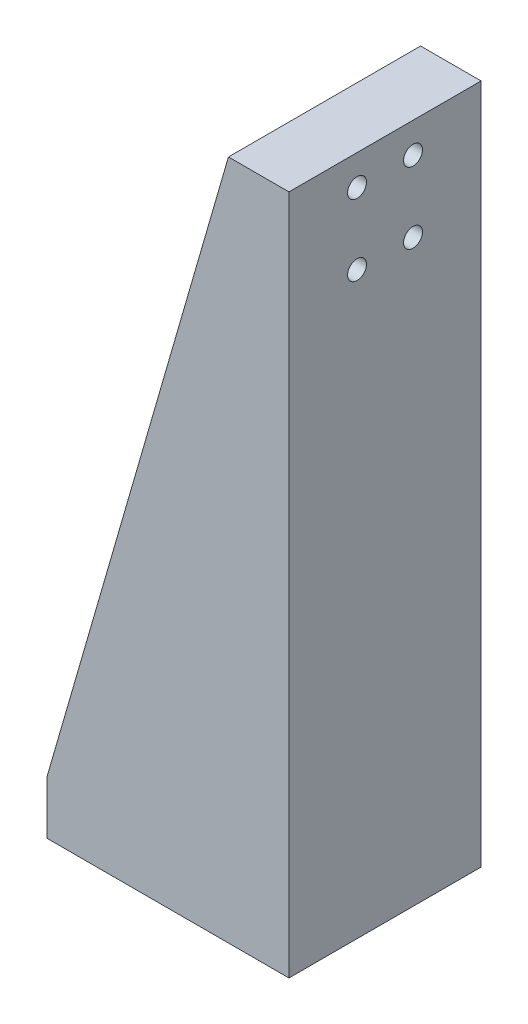
ISO-10303-21;
HEADER;
FILE_DESCRIPTION(('STEP AP214'),'2;1');
FILE_NAME('part.step','',(''),(''),'','','');
FILE_SCHEMA(('AUTOMOTIVE_DESIGN { 1 0 10303 214 1 1 1 1 }'));
ENDSEC;
DATA;
#1=APPLICATION_CONTEXT('core data for automotive mechanical design processes');
#2=APPLICATION_PROTOCOL_DEFINITION('international standard','automotive_design',2000,#1);
#3=PRODUCT_CONTEXT('',#1,'mechanical');
#4=PRODUCT('Part','Part','',(#3));
#5=PRODUCT_RELATED_PRODUCT_CATEGORY('part','',(#4));
#6=PRODUCT_DEFINITION_FORMATION('','',#4);
#7=PRODUCT_DEFINITION_CONTEXT('part definition',#1,'design');
#8=PRODUCT_DEFINITION('design','',#6,#7);
#9=PRODUCT_DEFINITION_SHAPE('','',#8);
#10=(LENGTH_UNIT() NAMED_UNIT(*) SI_UNIT(.MILLI.,.METRE.));
#11=(NAMED_UNIT(*) PLANE_ANGLE_UNIT() SI_UNIT($,.RADIAN.));
#12=(NAMED_UNIT(*) SI_UNIT($,.STERADIAN.) SOLID_ANGLE_UNIT());
#13=UNCERTAINTY_MEASURE_WITH_UNIT(LENGTH_MEASURE(1.E-05),#10,'distance_accuracy_value','');
#14=(GEOMETRIC_REPRESENTATION_CONTEXT(3) GLOBAL_UNCERTAINTY_ASSIGNED_CONTEXT((#13)) GLOBAL_UNIT_ASSIGNED_CONTEXT((#10,
#11,#12)) REPRESENTATION_CONTEXT('',''));
#15=CARTESIAN_POINT('',(0.,0.,0.));
#16=DIRECTION('',(0.,0.,1.));
#17=DIRECTION('',(1.,0.,0.));
#18=AXIS2_PLACEMENT_3D('',#15,#16,#17);
#19=CARTESIAN_POINT('',(32.,90.,25.4));
#20=DIRECTION('',(-1.,0.,0.));
#21=DIRECTION('',(0.,-1.,0.));
#22=AXIS2_PLACEMENT_3D('',#19,#20,#21);
#23=PLANE('',#22);
#24=DIRECTION('',(0.,1.,0.));
#25=VECTOR('',#24,1.);
#26=CARTESIAN_POINT('',(32.,90.,0.));
#27=LINE('',#26,#25);
#28=CARTESIAN_POINT('',(32.,0.,0.));
#29=VERTEX_POINT('',#28);
#30=CARTESIAN_POINT('',(32.,90.,0.));
#31=VERTEX_POINT('',#30);
#32=EDGE_CURVE('E138',#29,#31,#27,.T.);
#33=ORIENTED_EDGE('',*,*,#32,.T.);
#34=DIRECTION('',(0.,0.,-1.));
#35=VECTOR('',#34,1.);
#36=CARTESIAN_POINT('',(32.,90.,25.4));
#37=LINE('',#36,#35);
#38=CARTESIAN_POINT('',(32.,90.,25.4));
#39=VERTEX_POINT('',#38);
#40=EDGE_CURVE('E43',#39,#31,#37,.T.);
#41=ORIENTED_EDGE('',*,*,#40,.F.);
#42=DIRECTION('',(0.,1.,0.));
#43=VECTOR('',#42,1.);
#44=CARTESIAN_POINT('',(32.,90.,25.4));
#45=LINE('',#44,#43);
#46=CARTESIAN_POINT('',(32.,0.,25.4));
#47=VERTEX_POINT('',#46);
#48=EDGE_CURVE('E118',#47,#39,#45,.T.);
#49=ORIENTED_EDGE('',*,*,#48,.F.);
#50=DIRECTION('',(0.,0.,-1.));
#51=VECTOR('',#50,1.);
#52=CARTESIAN_POINT('',(32.,0.,25.4));
#53=LINE('',#52,#51);
#54=EDGE_CURVE('E11',#47,#29,#53,.T.);
#55=ORIENTED_EDGE('',*,*,#54,.T.);
#56=EDGE_LOOP('',(#33,#41,#49,#55));
#57=FACE_BOUND('',#56,.T.);
#58=CARTESIAN_POINT('',(32.,76.6,9.));
#59=DIRECTION('',(1.,0.,0.));
#60=DIRECTION('',(0.,0.,-1.));
#61=AXIS2_PLACEMENT_3D('',#58,#59,#60);
#62=CIRCLE('',#61,1.25);
#63=CARTESIAN_POINT('',(32.,76.6,7.75));
#64=VERTEX_POINT('',#63);
#65=EDGE_CURVE('E192',#64,#64,#62,.T.);
#66=ORIENTED_EDGE('',*,*,#65,.F.);
#67=EDGE_LOOP('',(#66));
#68=FACE_BOUND('',#67,.T.);
#69=CARTESIAN_POINT('',(32.,86.,16.4));
#70=DIRECTION('',(1.,0.,0.));
#71=DIRECTION('',(0.,0.,-1.));
#72=AXIS2_PLACEMENT_3D('',#69,#70,#71);
#73=CIRCLE('',#72,1.25);
#74=CARTESIAN_POINT('',(32.,86.,15.15));
#75=VERTEX_POINT('',#74);
#76=EDGE_CURVE('E198',#75,#75,#73,.T.);
#77=ORIENTED_EDGE('',*,*,#76,.F.);
#78=EDGE_LOOP('',(#77));
#79=FACE_BOUND('',#78,.T.);
#80=CARTESIAN_POINT('',(32.,76.6,16.4));
#81=DIRECTION('',(1.,0.,0.));
#82=DIRECTION('',(0.,0.,-1.));
#83=AXIS2_PLACEMENT_3D('',#80,#81,#82);
#84=CIRCLE('',#83,1.25);
#85=CARTESIAN_POINT('',(32.,76.6,15.15));
#86=VERTEX_POINT('',#85);
#87=EDGE_CURVE('E204',#86,#86,#84,.T.);
#88=ORIENTED_EDGE('',*,*,#87,.F.);
#89=EDGE_LOOP('',(#88));
#90=FACE_BOUND('',#89,.T.);
#91=CARTESIAN_POINT('',(32.,86.,9.));
#92=DIRECTION('',(1.,0.,0.));
#93=DIRECTION('',(0.,0.,-1.));
#94=AXIS2_PLACEMENT_3D('',#91,#92,#93);
#95=CIRCLE('',#94,1.25);
#96=CARTESIAN_POINT('',(32.,86.,7.75));
#97=VERTEX_POINT('',#96);
#98=EDGE_CURVE('E210',#97,#97,#95,.T.);
#99=ORIENTED_EDGE('',*,*,#98,.F.);
#100=EDGE_LOOP('',(#99));
#101=FACE_BOUND('',#100,.T.);
#102=ADVANCED_FACE('F35',(#57,#68,#79,#90,#101),#23,.F.);
#103=CARTESIAN_POINT('',(24.,7.,25.4));
#104=DIRECTION('',(1.,0.,0.));
#105=DIRECTION('',(0.,0.,-1.));
#106=AXIS2_PLACEMENT_3D('',#103,#104,#105);
#107=PLANE('',#106);
#108=CARTESIAN_POINT('',(24.,86.,9.));
#109=DIRECTION('',(1.,0.,0.));
#110=DIRECTION('',(0.,0.,-1.));
#111=AXIS2_PLACEMENT_3D('',#108,#109,#110);
#112=CIRCLE('',#111,1.25);
#113=CARTESIAN_POINT('',(24.,86.,7.75));
#114=VERTEX_POINT('',#113);
#115=EDGE_CURVE('E207',#114,#114,#112,.T.);
#116=ORIENTED_EDGE('',*,*,#115,.T.);
#117=EDGE_LOOP('',(#116));
#118=FACE_BOUND('',#117,.T.);
#119=CARTESIAN_POINT('',(24.,76.6,16.4));
#120=DIRECTION('',(1.,0.,0.));
#121=DIRECTION('',(0.,0.,-1.));
#122=AXIS2_PLACEMENT_3D('',#119,#120,#121);
#123=CIRCLE('',#122,1.25);
#124=CARTESIAN_POINT('',(24.,76.6,15.15));
#125=VERTEX_POINT('',#124);
#126=EDGE_CURVE('E201',#125,#125,#123,.T.);
#127=ORIENTED_EDGE('',*,*,#126,.T.);
#128=EDGE_LOOP('',(#127));
#129=FACE_BOUND('',#128,.T.);
#130=CARTESIAN_POINT('',(24.,86.,16.4));
#131=DIRECTION('',(1.,0.,0.));
#132=DIRECTION('',(0.,0.,-1.));
#133=AXIS2_PLACEMENT_3D('',#130,#131,#132);
#134=CIRCLE('',#133,1.25);
#135=CARTESIAN_POINT('',(24.,86.,15.15));
#136=VERTEX_POINT('',#135);
#137=EDGE_CURVE('E195',#136,#136,#134,.T.);
#138=ORIENTED_EDGE('',*,*,#137,.T.);
#139=EDGE_LOOP('',(#138));
#140=FACE_BOUND('',#139,.T.);
#141=CARTESIAN_POINT('',(24.,76.6,9.));
#142=DIRECTION('',(1.,0.,0.));
#143=DIRECTION('',(0.,0.,-1.));
#144=AXIS2_PLACEMENT_3D('',#141,#142,#143);
#145=CIRCLE('',#144,1.25);
#146=CARTESIAN_POINT('',(24.,76.6,7.75));
#147=VERTEX_POINT('',#146);
#148=EDGE_CURVE('E179',#147,#147,#145,.T.);
#149=ORIENTED_EDGE('',*,*,#148,.T.);
#150=EDGE_LOOP('',(#149));
#151=FACE_BOUND('',#150,.T.);
#152=DIRECTION('',(0.,1.,0.));
#153=VECTOR('',#152,1.);
#154=CARTESIAN_POINT('',(24.,7.,5.));
#155=LINE('',#154,#153);
#156=CARTESIAN_POINT('',(24.,7.,5.));
#157=VERTEX_POINT('',#156);
#158=CARTESIAN_POINT('',(24.,90.,5.));
#159=VERTEX_POINT('',#158);
#160=EDGE_CURVE('E50',#157,#159,#155,.T.);
#161=ORIENTED_EDGE('',*,*,#160,.F.);
#162=DIRECTION('',(0.,0.,-1.));
#163=VECTOR('',#162,1.);
#164=CARTESIAN_POINT('',(24.,7.,25.4));
#165=LINE('',#164,#163);
#166=CARTESIAN_POINT('',(24.,7.,20.4));
#167=VERTEX_POINT('',#166);
#168=EDGE_CURVE('E125',#167,#157,#165,.T.);
#169=ORIENTED_EDGE('',*,*,#168,.F.);
#170=DIRECTION('',(0.,-1.,0.));
#171=VECTOR('',#170,1.);
#172=CARTESIAN_POINT('',(24.,7.,20.4));
#173=LINE('',#172,#171);
#174=CARTESIAN_POINT('',(24.,90.,20.4));
#175=VERTEX_POINT('',#174);
#176=EDGE_CURVE('E144',#175,#167,#173,.T.);
#177=ORIENTED_EDGE('',*,*,#176,.F.);
#178=DIRECTION('',(0.,0.,-1.));
#179=VECTOR('',#178,1.);
#180=CARTESIAN_POINT('',(24.,90.,25.4));
#181=LINE('',#180,#179);
#182=EDGE_CURVE('E123',#175,#159,#181,.T.);
#183=ORIENTED_EDGE('',*,*,#182,.T.);
#184=EDGE_LOOP('',(#161,#169,#177,#183));
#185=FACE_BOUND('',#184,.T.);
#186=ADVANCED_FACE('F217',(#118,#129,#140,#151,#185),#107,.F.);
#187=CARTESIAN_POINT('',(0.,7.,25.4));
#188=DIRECTION('',(0.,-1.,0.));
#189=DIRECTION('',(0.,0.,-1.));
#190=AXIS2_PLACEMENT_3D('',#187,#188,#189);
#191=PLANE('',#190);
#192=CARTESIAN_POINT('',(4.,7.,16.4));
#193=DIRECTION('',(0.,1.,0.));
#194=DIRECTION('',(0.,0.,1.));
#195=AXIS2_PLACEMENT_3D('',#192,#193,#194);
#196=CIRCLE('',#195,1.55);
#197=CARTESIAN_POINT('',(4.,7.,17.95));
#198=VERTEX_POINT('',#197);
#199=EDGE_CURVE('E176',#198,#198,#196,.T.);
#200=ORIENTED_EDGE('',*,*,#199,.F.);
#201=EDGE_LOOP('',(#200));
#202=FACE_BOUND('',#201,.T.);
#203=CARTESIAN_POINT('',(20.,7.,16.4));
#204=DIRECTION('',(0.,1.,0.));
#205=DIRECTION('',(0.,0.,1.));
#206=AXIS2_PLACEMENT_3D('',#203,#204,#205);
#207=CIRCLE('',#206,1.55);
#208=CARTESIAN_POINT('',(20.,7.,17.95));
#209=VERTEX_POINT('',#208);
#210=EDGE_CURVE('E175',#209,#209,#207,.T.);
#211=ORIENTED_EDGE('',*,*,#210,.F.);
#212=EDGE_LOOP('',(#211));
#213=FACE_BOUND('',#212,.T.);
#214=CARTESIAN_POINT('',(20.,7.,9.));
#215=DIRECTION('',(0.,1.,0.));
#216=DIRECTION('',(0.,0.,1.));
#217=AXIS2_PLACEMENT_3D('',#214,#215,#216);
#218=CIRCLE('',#217,1.55);
#219=CARTESIAN_POINT('',(20.,7.,10.55));
#220=VERTEX_POINT('',#219);
#221=EDGE_CURVE('E183',#220,#220,#218,.T.);
#222=ORIENTED_EDGE('',*,*,#221,.F.);
#223=EDGE_LOOP('',(#222));
#224=FACE_BOUND('',#223,.T.);
#225=CARTESIAN_POINT('',(4.,7.,9.));
#226=DIRECTION('',(0.,1.,0.));
#227=DIRECTION('',(0.,0.,1.));
#228=AXIS2_PLACEMENT_3D('',#225,#226,#227);
#229=CIRCLE('',#228,1.55);
#230=CARTESIAN_POINT('',(4.,7.,10.55));
#231=VERTEX_POINT('',#230);
#232=EDGE_CURVE('E168',#231,#231,#229,.T.);
#233=ORIENTED_EDGE('',*,*,#232,.F.);
#234=EDGE_LOOP('',(#233));
#235=FACE_BOUND('',#234,.T.);
#236=DIRECTION('',(1.,0.,0.));
#237=VECTOR('',#236,1.);
#238=CARTESIAN_POINT('',(0.,7.,5.));
#239=LINE('',#238,#237);
#240=CARTESIAN_POINT('',(0.,7.,5.));
#241=VERTEX_POINT('',#240);
#242=EDGE_CURVE('E152',#241,#157,#239,.T.);
#243=ORIENTED_EDGE('',*,*,#242,.F.);
#244=DIRECTION('',(0.,0.,-1.));
#245=VECTOR('',#244,1.);
#246=CARTESIAN_POINT('',(0.,7.,25.4));
#247=LINE('',#246,#245);
#248=CARTESIAN_POINT('',(0.,7.00000000000003,20.4));
#249=VERTEX_POINT('',#248);
#250=EDGE_CURVE('E129',#249,#241,#247,.T.);
#251=ORIENTED_EDGE('',*,*,#250,.F.);
#252=DIRECTION('',(-1.,0.,0.));
#253=VECTOR('',#252,1.);
#254=CARTESIAN_POINT('',(0.,7.,20.4));
#255=LINE('',#254,#253);
#256=EDGE_CURVE('E111',#167,#249,#255,.T.);
#257=ORIENTED_EDGE('',*,*,#256,.F.);
#258=ORIENTED_EDGE('',*,*,#168,.T.);
#259=EDGE_LOOP('',(#243,#251,#257,#258));
#260=FACE_BOUND('',#259,.T.);
#261=ADVANCED_FACE('F222',(#202,#213,#224,#235,#260),#191,.F.);
#262=CARTESIAN_POINT('',(32.,0.,25.4));
#263=DIRECTION('',(0.,1.,0.));
#264=DIRECTION('',(-1.,0.,0.));
#265=AXIS2_PLACEMENT_3D('',#262,#263,#264);
#266=PLANE('',#265);
#267=CARTESIAN_POINT('',(4.,0.,16.4));
#268=DIRECTION('',(0.,1.,0.));
#269=DIRECTION('',(-1.,0.,0.));
#270=AXIS2_PLACEMENT_3D('',#267,#268,#269);
#271=CIRCLE('',#270,1.55);
#272=CARTESIAN_POINT('',(2.45,0.,16.4));
#273=VERTEX_POINT('',#272);
#274=EDGE_CURVE('E172',#273,#273,#271,.F.);
#275=ORIENTED_EDGE('',*,*,#274,.F.);
#276=EDGE_LOOP('',(#275));
#277=FACE_BOUND('',#276,.T.);
#278=CARTESIAN_POINT('',(20.,0.,16.4));
#279=DIRECTION('',(0.,1.,0.));
#280=DIRECTION('',(-1.,0.,0.));
#281=AXIS2_PLACEMENT_3D('',#278,#279,#280);
#282=CIRCLE('',#281,1.55);
#283=CARTESIAN_POINT('',(18.45,0.,16.4));
#284=VERTEX_POINT('',#283);
#285=EDGE_CURVE('E180',#284,#284,#282,.F.);
#286=ORIENTED_EDGE('',*,*,#285,.F.);
#287=EDGE_LOOP('',(#286));
#288=FACE_BOUND('',#287,.T.);
#289=CARTESIAN_POINT('',(20.,0.,9.));
#290=DIRECTION('',(0.,1.,0.));
#291=DIRECTION('',(-1.,0.,0.));
#292=AXIS2_PLACEMENT_3D('',#289,#290,#291);
#293=CIRCLE('',#292,1.55);
#294=CARTESIAN_POINT('',(18.45,0.,9.));
#295=VERTEX_POINT('',#294);
#296=EDGE_CURVE('E171',#295,#295,#293,.F.);
#297=ORIENTED_EDGE('',*,*,#296,.F.);
#298=EDGE_LOOP('',(#297));
#299=FACE_BOUND('',#298,.T.);
#300=CARTESIAN_POINT('',(4.,0.,9.));
#301=DIRECTION('',(0.,1.,0.));
#302=DIRECTION('',(-1.,0.,0.));
#303=AXIS2_PLACEMENT_3D('',#300,#301,#302);
#304=CIRCLE('',#303,1.55);
#305=CARTESIAN_POINT('',(2.45,0.,9.));
#306=VERTEX_POINT('',#305);
#307=EDGE_CURVE('E163',#306,#306,#304,.F.);
#308=ORIENTED_EDGE('',*,*,#307,.F.);
#309=EDGE_LOOP('',(#308));
#310=FACE_BOUND('',#309,.T.);
#311=DIRECTION('',(1.,0.,0.));
#312=VECTOR('',#311,1.);
#313=CARTESIAN_POINT('',(32.,0.,0.));
#314=LINE('',#313,#312);
#315=CARTESIAN_POINT('',(0.,0.,0.));
#316=VERTEX_POINT('',#315);
#317=EDGE_CURVE('E141',#316,#29,#314,.T.);
#318=ORIENTED_EDGE('',*,*,#317,.T.);
#319=ORIENTED_EDGE('',*,*,#54,.F.);
#320=DIRECTION('',(1.,0.,0.));
#321=VECTOR('',#320,1.);
#322=CARTESIAN_POINT('',(32.,0.,25.4));
#323=LINE('',#322,#321);
#324=CARTESIAN_POINT('',(0.,0.,25.4));
#325=VERTEX_POINT('',#324);
#326=EDGE_CURVE('E135',#325,#47,#323,.T.);
#327=ORIENTED_EDGE('',*,*,#326,.F.);
#328=DIRECTION('',(0.,0.,-1.));
#329=VECTOR('',#328,1.);
#330=CARTESIAN_POINT('',(0.,0.,25.4));
#331=LINE('',#330,#329);
#332=EDGE_CURVE('E130',#325,#316,#331,.T.);
#333=ORIENTED_EDGE('',*,*,#332,.T.);
#334=EDGE_LOOP('',(#318,#319,#327,#333));
#335=FACE_BOUND('',#334,.T.);
#336=ADVANCED_FACE('F37',(#277,#288,#299,#310,#335),#266,.F.);
#337=CARTESIAN_POINT('',(24.,90.,25.4));
#338=DIRECTION('',(0.,-1.,0.));
#339=DIRECTION('',(0.,0.,-1.));
#340=AXIS2_PLACEMENT_3D('',#337,#338,#339);
#341=PLANE('',#340);
#342=DIRECTION('',(0.,0.,1.));
#343=VECTOR('',#342,1.);
#344=CARTESIAN_POINT('',(24.,90.,25.4));
#345=LINE('',#344,#343);
#346=CARTESIAN_POINT('',(24.,90.,0.));
#347=VERTEX_POINT('',#346);
#348=EDGE_CURVE('E58',#159,#347,#345,.F.);
#349=ORIENTED_EDGE('',*,*,#348,.F.);
#350=ORIENTED_EDGE('',*,*,#182,.F.);
#351=CARTESIAN_POINT('',(23.9999999999999,89.9999999999996,25.4));
#352=VERTEX_POINT('',#351);
#353=EDGE_CURVE('E105',#352,#175,#181,.T.);
#354=ORIENTED_EDGE('',*,*,#353,.F.);
#355=DIRECTION('',(-1.,0.,0.));
#356=VECTOR('',#355,1.);
#357=CARTESIAN_POINT('',(24.,90.,25.4));
#358=LINE('',#357,#356);
#359=EDGE_CURVE('E115',#39,#352,#358,.T.);
#360=ORIENTED_EDGE('',*,*,#359,.F.);
#361=ORIENTED_EDGE('',*,*,#40,.T.);
#362=DIRECTION('',(-1.,0.,0.));
#363=VECTOR('',#362,1.);
#364=CARTESIAN_POINT('',(24.,90.,0.));
#365=LINE('',#364,#363);
#366=EDGE_CURVE('E136',#31,#347,#365,.T.);
#367=ORIENTED_EDGE('',*,*,#366,.T.);
#368=EDGE_LOOP('',(#349,#350,#354,#360,#361,#367));
#369=FACE_BOUND('',#368,.T.);
#370=ADVANCED_FACE('F122',(#369),#341,.F.);
#371=CARTESIAN_POINT('',(0.,0.,25.4));
#372=DIRECTION('',(1.,0.,0.));
#373=DIRECTION('',(0.,0.,-1.));
#374=AXIS2_PLACEMENT_3D('',#371,#372,#373);
#375=PLANE('',#374);
#376=DIRECTION('',(0.,-1.,0.));
#377=VECTOR('',#376,1.);
#378=CARTESIAN_POINT('',(0.,0.,0.));
#379=LINE('',#378,#377);
#380=CARTESIAN_POINT('',(0.,7.,0.));
#381=VERTEX_POINT('',#380);
#382=EDGE_CURVE('E132',#381,#316,#379,.T.);
#383=ORIENTED_EDGE('',*,*,#382,.T.);
#384=ORIENTED_EDGE('',*,*,#332,.F.);
#385=DIRECTION('',(0.,-1.,0.));
#386=VECTOR('',#385,1.);
#387=CARTESIAN_POINT('',(0.,0.,25.4));
#388=LINE('',#387,#386);
#389=CARTESIAN_POINT('',(0.,7.,25.4));
#390=VERTEX_POINT('',#389);
#391=EDGE_CURVE('E120',#390,#325,#388,.T.);
#392=ORIENTED_EDGE('',*,*,#391,.F.);
#393=EDGE_CURVE('E108',#390,#249,#247,.T.);
#394=ORIENTED_EDGE('',*,*,#393,.T.);
#395=ORIENTED_EDGE('',*,*,#250,.T.);
#396=DIRECTION('',(0.,0.,-1.));
#397=VECTOR('',#396,1.);
#398=CARTESIAN_POINT('',(0.,7.,25.4));
#399=LINE('',#398,#397);
#400=EDGE_CURVE('E156',#381,#241,#399,.F.);
#401=ORIENTED_EDGE('',*,*,#400,.F.);
#402=EDGE_LOOP('',(#383,#384,#392,#394,#395,#401));
#403=FACE_BOUND('',#402,.T.);
#404=ADVANCED_FACE('F228',(#403),#375,.F.);
#405=CARTESIAN_POINT('',(0.,0.,25.4));
#406=DIRECTION('',(0.,0.,-1.));
#407=DIRECTION('',(-1.,0.,0.));
#408=AXIS2_PLACEMENT_3D('',#405,#406,#407);
#409=PLANE('',#408);
#410=ORIENTED_EDGE('',*,*,#326,.T.);
#411=ORIENTED_EDGE('',*,*,#48,.T.);
#412=ORIENTED_EDGE('',*,*,#359,.T.);
#413=DIRECTION('',(-0.277777033563043,-0.960645574405523,0.));
#414=VECTOR('',#413,1.);
#415=CARTESIAN_POINT('',(24.,90.,25.4));
#416=LINE('',#415,#414);
#417=EDGE_CURVE('E100',#352,#390,#416,.T.);
#418=ORIENTED_EDGE('',*,*,#417,.T.);
#419=ORIENTED_EDGE('',*,*,#391,.T.);
#420=EDGE_LOOP('',(#410,#411,#412,#418,#419));
#421=FACE_BOUND('',#420,.T.);
#422=ADVANCED_FACE('F117',(#421),#409,.F.);
#423=CARTESIAN_POINT('',(0.,0.,0.));
#424=DIRECTION('',(0.,0.,-1.));
#425=DIRECTION('',(-1.,0.,0.));
#426=AXIS2_PLACEMENT_3D('',#423,#424,#425);
#427=PLANE('',#426);
#428=ORIENTED_EDGE('',*,*,#382,.F.);
#429=DIRECTION('',(-0.277777033563043,-0.960645574405523,0.));
#430=VECTOR('',#429,1.);
#431=CARTESIAN_POINT('',(24.,90.,0.));
#432=LINE('',#431,#430);
#433=EDGE_CURVE('E159',#347,#381,#432,.T.);
#434=ORIENTED_EDGE('',*,*,#433,.F.);
#435=ORIENTED_EDGE('',*,*,#366,.F.);
#436=ORIENTED_EDGE('',*,*,#32,.F.);
#437=ORIENTED_EDGE('',*,*,#317,.F.);
#438=EDGE_LOOP('',(#428,#434,#435,#436,#437));
#439=FACE_BOUND('',#438,.T.);
#440=ADVANCED_FACE('F236',(#439),#427,.T.);
#441=CARTESIAN_POINT('',(16.,45.,20.4));
#442=DIRECTION('',(0.,0.,1.));
#443=DIRECTION('',(1.,0.,0.));
#444=AXIS2_PLACEMENT_3D('',#441,#442,#443);
#445=PLANE('',#444);
#446=DIRECTION('',(-0.277777033563043,-0.960645574405523,0.));
#447=VECTOR('',#446,1.);
#448=CARTESIAN_POINT('',(24.,90.,20.4));
#449=LINE('',#448,#447);
#450=EDGE_CURVE('E112',#175,#249,#449,.T.);
#451=ORIENTED_EDGE('',*,*,#450,.F.);
#452=ORIENTED_EDGE('',*,*,#176,.T.);
#453=ORIENTED_EDGE('',*,*,#256,.T.);
#454=EDGE_LOOP('',(#451,#452,#453));
#455=FACE_BOUND('',#454,.T.);
#456=ADVANCED_FACE('F239',(#455),#445,.F.);
#457=CARTESIAN_POINT('',(24.,90.,25.4));
#458=DIRECTION('',(-0.960645574405523,0.277777033563043,0.));
#459=DIRECTION('',(-0.277777033563043,-0.960645574405523,0.));
#460=AXIS2_PLACEMENT_3D('',#457,#458,#459);
#461=PLANE('',#460);
#462=ORIENTED_EDGE('',*,*,#353,.T.);
#463=ORIENTED_EDGE('',*,*,#450,.T.);
#464=ORIENTED_EDGE('',*,*,#393,.F.);
#465=ORIENTED_EDGE('',*,*,#417,.F.);
#466=EDGE_LOOP('',(#462,#463,#464,#465));
#467=FACE_BOUND('',#466,.T.);
#468=ADVANCED_FACE('F102',(#467),#461,.T.);
#469=CARTESIAN_POINT('',(16.,45.,5.));
#470=DIRECTION('',(0.,0.,-1.));
#471=DIRECTION('',(-1.,0.,0.));
#472=AXIS2_PLACEMENT_3D('',#469,#470,#471);
#473=PLANE('',#472);
#474=ORIENTED_EDGE('',*,*,#242,.T.);
#475=ORIENTED_EDGE('',*,*,#160,.T.);
#476=DIRECTION('',(-0.277777033563043,-0.960645574405523,0.));
#477=VECTOR('',#476,1.);
#478=CARTESIAN_POINT('',(24.,90.,5.));
#479=LINE('',#478,#477);
#480=EDGE_CURVE('E160',#159,#241,#479,.T.);
#481=ORIENTED_EDGE('',*,*,#480,.T.);
#482=EDGE_LOOP('',(#474,#475,#481));
#483=FACE_BOUND('',#482,.T.);
#484=ADVANCED_FACE('F245',(#483),#473,.F.);
#485=CARTESIAN_POINT('',(24.,90.,0.));
#486=DIRECTION('',(0.960645574405523,-0.277777033563043,0.));
#487=DIRECTION('',(-0.277777033563043,-0.960645574405523,0.));
#488=AXIS2_PLACEMENT_3D('',#485,#486,#487);
#489=PLANE('',#488);
#490=ORIENTED_EDGE('',*,*,#480,.F.);
#491=ORIENTED_EDGE('',*,*,#348,.T.);
#492=ORIENTED_EDGE('',*,*,#433,.T.);
#493=ORIENTED_EDGE('',*,*,#400,.T.);
#494=EDGE_LOOP('',(#490,#491,#492,#493));
#495=FACE_BOUND('',#494,.T.);
#496=ADVANCED_FACE('F249',(#495),#489,.F.);
#497=CARTESIAN_POINT('',(4.,-0.00100000000000013,9.));
#498=DIRECTION('',(0.,1.,0.));
#499=DIRECTION('',(0.,0.,1.));
#500=AXIS2_PLACEMENT_3D('',#497,#498,#499);
#501=CYLINDRICAL_SURFACE('',#500,1.55);
#502=ORIENTED_EDGE('',*,*,#232,.T.);
#503=EDGE_LOOP('',(#502));
#504=FACE_BOUND('',#503,.T.);
#505=ORIENTED_EDGE('',*,*,#307,.T.);
#506=EDGE_LOOP('',(#505));
#507=FACE_BOUND('',#506,.T.);
#508=ADVANCED_FACE('F252',(#504,#507),#501,.F.);
#509=CARTESIAN_POINT('',(20.,-0.00100000000000013,9.));
#510=DIRECTION('',(0.,1.,0.));
#511=DIRECTION('',(0.,0.,1.));
#512=AXIS2_PLACEMENT_3D('',#509,#510,#511);
#513=CYLINDRICAL_SURFACE('',#512,1.55);
#514=ORIENTED_EDGE('',*,*,#221,.T.);
#515=EDGE_LOOP('',(#514));
#516=FACE_BOUND('',#515,.T.);
#517=ORIENTED_EDGE('',*,*,#296,.T.);
#518=EDGE_LOOP('',(#517));
#519=FACE_BOUND('',#518,.T.);
#520=ADVANCED_FACE('F259',(#516,#519),#513,.F.);
#521=CARTESIAN_POINT('',(20.,-0.00100000000000013,16.4));
#522=DIRECTION('',(0.,1.,0.));
#523=DIRECTION('',(0.,0.,1.));
#524=AXIS2_PLACEMENT_3D('',#521,#522,#523);
#525=CYLINDRICAL_SURFACE('',#524,1.55);
#526=ORIENTED_EDGE('',*,*,#210,.T.);
#527=EDGE_LOOP('',(#526));
#528=FACE_BOUND('',#527,.T.);
#529=ORIENTED_EDGE('',*,*,#285,.T.);
#530=EDGE_LOOP('',(#529));
#531=FACE_BOUND('',#530,.T.);
#532=ADVANCED_FACE('F265',(#528,#531),#525,.F.);
#533=CARTESIAN_POINT('',(4.,-0.00100000000000013,16.4));
#534=DIRECTION('',(0.,1.,0.));
#535=DIRECTION('',(0.,0.,1.));
#536=AXIS2_PLACEMENT_3D('',#533,#534,#535);
#537=CYLINDRICAL_SURFACE('',#536,1.55);
#538=ORIENTED_EDGE('',*,*,#199,.T.);
#539=EDGE_LOOP('',(#538));
#540=FACE_BOUND('',#539,.T.);
#541=ORIENTED_EDGE('',*,*,#274,.T.);
#542=EDGE_LOOP('',(#541));
#543=FACE_BOUND('',#542,.T.);
#544=ADVANCED_FACE('F261',(#540,#543),#537,.F.);
#545=CARTESIAN_POINT('',(32.,76.6,9.));
#546=DIRECTION('',(1.,0.,0.));
#547=DIRECTION('',(0.,0.,-1.));
#548=AXIS2_PLACEMENT_3D('',#545,#546,#547);
#549=CYLINDRICAL_SURFACE('',#548,1.25);
#550=ORIENTED_EDGE('',*,*,#148,.F.);
#551=EDGE_LOOP('',(#550));
#552=FACE_BOUND('',#551,.T.);
#553=ORIENTED_EDGE('',*,*,#65,.T.);
#554=EDGE_LOOP('',(#553));
#555=FACE_BOUND('',#554,.T.);
#556=ADVANCED_FACE('F264',(#552,#555),#549,.F.);
#557=CARTESIAN_POINT('',(32.,86.,16.4));
#558=DIRECTION('',(1.,0.,0.));
#559=DIRECTION('',(0.,0.,-1.));
#560=AXIS2_PLACEMENT_3D('',#557,#558,#559);
#561=CYLINDRICAL_SURFACE('',#560,1.25);
#562=ORIENTED_EDGE('',*,*,#137,.F.);
#563=EDGE_LOOP('',(#562));
#564=FACE_BOUND('',#563,.T.);
#565=ORIENTED_EDGE('',*,*,#76,.T.);
#566=EDGE_LOOP('',(#565));
#567=FACE_BOUND('',#566,.T.);
#568=ADVANCED_FACE('F275',(#564,#567),#561,.F.);
#569=CARTESIAN_POINT('',(32.,76.6,16.4));
#570=DIRECTION('',(1.,0.,0.));
#571=DIRECTION('',(0.,0.,-1.));
#572=AXIS2_PLACEMENT_3D('',#569,#570,#571);
#573=CYLINDRICAL_SURFACE('',#572,1.25);
#574=ORIENTED_EDGE('',*,*,#126,.F.);
#575=EDGE_LOOP('',(#574));
#576=FACE_BOUND('',#575,.T.);
#577=ORIENTED_EDGE('',*,*,#87,.T.);
#578=EDGE_LOOP('',(#577));
#579=FACE_BOUND('',#578,.T.);
#580=ADVANCED_FACE('F279',(#576,#579),#573,.F.);
#581=CARTESIAN_POINT('',(32.,86.,9.));
#582=DIRECTION('',(1.,0.,0.));
#583=DIRECTION('',(0.,0.,-1.));
#584=AXIS2_PLACEMENT_3D('',#581,#582,#583);
#585=CYLINDRICAL_SURFACE('',#584,1.25);
#586=ORIENTED_EDGE('',*,*,#115,.F.);
#587=EDGE_LOOP('',(#586));
#588=FACE_BOUND('',#587,.T.);
#589=ORIENTED_EDGE('',*,*,#98,.T.);
#590=EDGE_LOOP('',(#589));
#591=FACE_BOUND('',#590,.T.);
#592=ADVANCED_FACE('F214',(#588,#591),#585,.F.);
#593=CLOSED_SHELL('',(#102,#186,#261,#336,#370,#404,#422,#440,#456,#468,#484,#496,#508,#520,
#532,#544,#556,#568,#580,#592));
#594=MANIFOLD_SOLID_BREP('B2',#593);
#595=ADVANCED_BREP_SHAPE_REPRESENTATION('',(#18,#594),#14);
#596=SHAPE_DEFINITION_REPRESENTATION(#9,#595);
ENDSEC;
END-ISO-10303-21;
